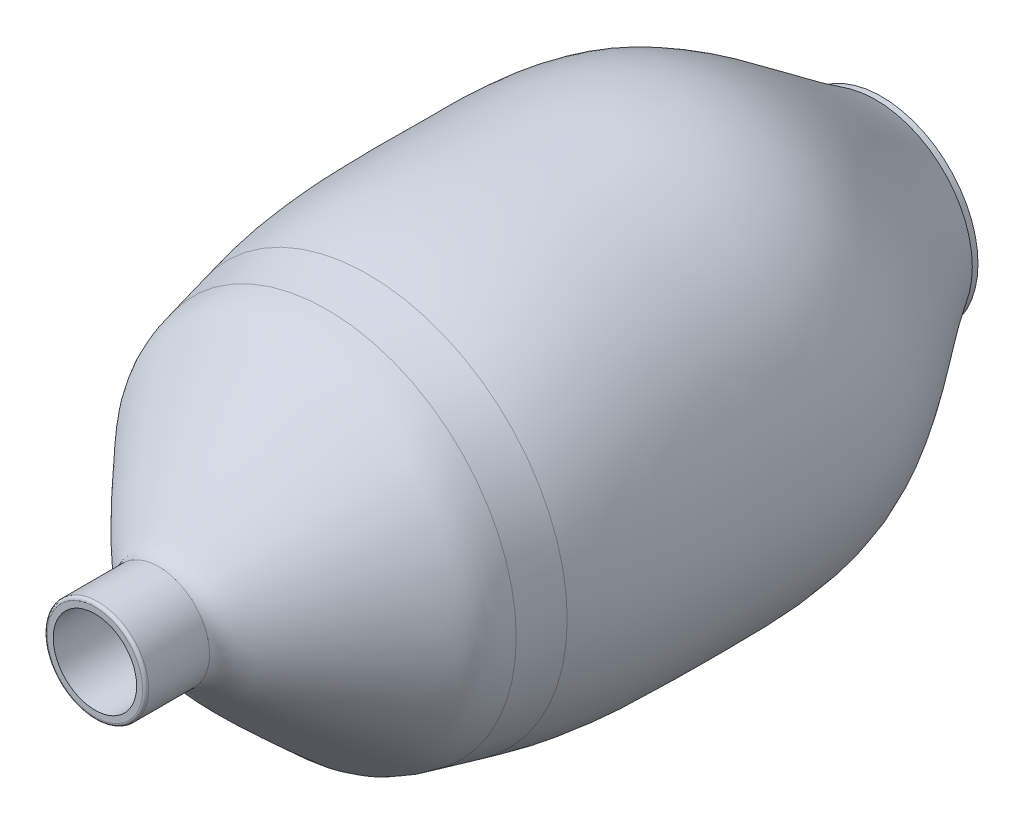
ISO-10303-21;
HEADER;
FILE_DESCRIPTION(('STEP AP214'),'2;1');
FILE_NAME('part.step','',(''),(''),'','','');
FILE_SCHEMA(('AUTOMOTIVE_DESIGN { 1 0 10303 214 1 1 1 1 }'));
ENDSEC;
DATA;
#1=APPLICATION_CONTEXT('core data for automotive mechanical design processes');
#2=APPLICATION_PROTOCOL_DEFINITION('international standard','automotive_design',2000,#1);
#3=PRODUCT_CONTEXT('',#1,'mechanical');
#4=PRODUCT('Part','Part','',(#3));
#5=PRODUCT_RELATED_PRODUCT_CATEGORY('part','',(#4));
#6=PRODUCT_DEFINITION_FORMATION('','',#4);
#7=PRODUCT_DEFINITION_CONTEXT('part definition',#1,'design');
#8=PRODUCT_DEFINITION('design','',#6,#7);
#9=PRODUCT_DEFINITION_SHAPE('','',#8);
#10=(LENGTH_UNIT() NAMED_UNIT(*) SI_UNIT(.MILLI.,.METRE.));
#11=(NAMED_UNIT(*) PLANE_ANGLE_UNIT() SI_UNIT($,.RADIAN.));
#12=(NAMED_UNIT(*) SI_UNIT($,.STERADIAN.) SOLID_ANGLE_UNIT());
#13=UNCERTAINTY_MEASURE_WITH_UNIT(LENGTH_MEASURE(1.E-05),#10,'distance_accuracy_value','');
#14=(GEOMETRIC_REPRESENTATION_CONTEXT(3) GLOBAL_UNCERTAINTY_ASSIGNED_CONTEXT((#13)) GLOBAL_UNIT_ASSIGNED_CONTEXT((#10,
#11,#12)) REPRESENTATION_CONTEXT('',''));
#15=CARTESIAN_POINT('',(0.,0.,0.));
#16=DIRECTION('',(0.,0.,1.));
#17=DIRECTION('',(1.,0.,0.));
#18=AXIS2_PLACEMENT_3D('',#15,#16,#17);
#19=CARTESIAN_POINT('',(0.,425.417840367619,-161.758556822154));
#20=CARTESIAN_POINT('',(0.,425.425512714381,-161.819419658135));
#21=CARTESIAN_POINT('',(0.,425.438145406539,-161.923120578848));
#22=CARTESIAN_POINT('',(0.,425.485106801781,-162.274720430272));
#23=CARTESIAN_POINT('',(0.,425.57793153603,-162.818178628396));
#24=CARTESIAN_POINT('',(0.,425.834440667119,-163.912921631338));
#25=CARTESIAN_POINT('',(0.,426.594243838935,-165.908538220751));
#26=CARTESIAN_POINT('',(0.,428.219309129448,-168.218246536566));
#27=CARTESIAN_POINT('',(0.,430.440677457558,-170.253422655751));
#28=CARTESIAN_POINT('',(0.,432.530119229495,-171.873383547063));
#29=CARTESIAN_POINT('',(0.,434.434741866312,-173.443350782065));
#30=CARTESIAN_POINT('',(0.,436.971222573604,-175.634399052684));
#31=CARTESIAN_POINT('',(0.,440.064030862751,-178.464087020507));
#32=CARTESIAN_POINT('',(0.,443.697716994735,-181.967987343029));
#33=CARTESIAN_POINT('',(0.,447.264008098938,-185.564282324131));
#34=CARTESIAN_POINT('',(0.,450.786660258123,-189.237236911521));
#35=CARTESIAN_POINT('',(0.,454.286260441308,-192.97079451453));
#36=CARTESIAN_POINT('',(0.,457.78307286654,-196.748383607076));
#37=CARTESIAN_POINT('',(0.,460.715970121881,-199.920029625462));
#38=CARTESIAN_POINT('',(0.,463.076565309463,-202.461471470719));
#39=CARTESIAN_POINT('',(0.,464.87674219713,-204.371809299966));
#40=CARTESIAN_POINT('',(0.,466.537080563887,-206.193375260955));
#41=CARTESIAN_POINT('',(0.,467.961738554563,-207.988492092352));
#42=CARTESIAN_POINT('',(0.,469.061554178301,-209.784645286835));
#43=CARTESIAN_POINT('',(0.,469.978689704152,-211.812427442754));
#44=CARTESIAN_POINT('',(0.,470.7294330568,-214.014031173279));
#45=CARTESIAN_POINT('',(0.,471.559261311098,-217.15353799278));
#46=CARTESIAN_POINT('',(0.,472.364854146844,-221.356158221017));
#47=CARTESIAN_POINT('',(0.,473.02842492808,-224.841883019088));
#48=CARTESIAN_POINT('',(0.,473.430003641095,-226.553419869668));
#49=B_SPLINE_CURVE_WITH_KNOTS('',3,(#19,#20,#21,#22,#23,#24,#25,#26,#27,#28,#29,#30,#31,#32,#33,
#34,#35,#36,#37,#38,#39,#40,#41,#42,#43,#44,#45,#46,#47,#48),.UNSPECIFIED.,.F.,.F.,(4,1,1,1,1,1,
1,1,1,1,1,1,1,1,1,1,1,1,1,1,1,1,1,1,1,1,1,4),(-0.00200560718281765,-4.59020192296008E-05,
0.00191380314435844,0.00583321347153453,0.0136720341258867,0.0293496754345911,
0.0607049580519998,0.0920602406694085,0.123415523286817,0.154770805904226,0.186126088521635,
0.248836653756452,0.311547218991269,0.374257784226087,0.436968349460904,0.499678914695722,
0.562389479930539,0.625100045165357,0.656455327782765,0.687810610400174,0.719165893017583,
0.750521175634991,0.7818764582524,0.813231740869809,0.844587023487217,0.875942306104626,
0.938652871339444,1.00136343657426),.UNSPECIFIED.);
#50=CARTESIAN_POINT('',(0.,411.49576309933,-150.958062517965));
#51=DIRECTION('',(0.,0.,1.));
#52=AXIS1_PLACEMENT('',#50,#51);
#53=SURFACE_OF_REVOLUTION('',#49,#52);
#54=CARTESIAN_POINT('',(0.,411.49576309933,-226.553419869668));
#55=DIRECTION('',(0.,0.,1.));
#56=DIRECTION('',(1.,0.,0.));
#57=AXIS2_PLACEMENT_3D('',#54,#55,#56);
#58=CIRCLE('',#57,61.9342405417654);
#59=CARTESIAN_POINT('',(61.9342405417654,411.49576309933,-226.553419869668));
#60=VERTEX_POINT('',#59);
#61=EDGE_CURVE('E57',#60,#60,#58,.T.);
#62=ORIENTED_EDGE('',*,*,#61,.F.);
#63=EDGE_LOOP('',(#62));
#64=FACE_BOUND('',#63,.T.);
#65=CARTESIAN_POINT('',(0.,411.49576309933,-161.758556822154));
#66=DIRECTION('',(0.,0.,1.));
#67=DIRECTION('',(1.,0.,0.));
#68=AXIS2_PLACEMENT_3D('',#65,#66,#67);
#69=CIRCLE('',#68,13.9220772682896);
#70=CARTESIAN_POINT('',(13.9220772682896,411.49576309933,-161.758556822154));
#71=VERTEX_POINT('',#70);
#72=EDGE_CURVE('E81',#71,#71,#69,.T.);
#73=ORIENTED_EDGE('',*,*,#72,.T.);
#74=EDGE_LOOP('',(#73));
#75=FACE_BOUND('',#74,.T.);
#76=ADVANCED_FACE('F37',(#64,#75),#53,.T.);
#77=CARTESIAN_POINT('',(0.,473.430003641095,-226.553419869668));
#78=CARTESIAN_POINT('',(0.,473.730017583264,-227.511334155473));
#79=CARTESIAN_POINT('',(0.,474.313596578574,-229.44239532702));
#80=CARTESIAN_POINT('',(0.,475.370464774843,-233.257020053952));
#81=CARTESIAN_POINT('',(0.,476.518287603895,-237.999385716587));
#82=CARTESIAN_POINT('',(0.,477.637412490232,-243.642274171863));
#83=CARTESIAN_POINT('',(0.,478.823310695443,-251.124673242805));
#84=CARTESIAN_POINT('',(0.,479.796111148413,-260.426034200905));
#85=CARTESIAN_POINT('',(0.,480.356515998269,-271.595398427168));
#86=CARTESIAN_POINT('',(0.,480.523776332559,-282.853796923385));
#87=CARTESIAN_POINT('',(0.,480.496092928094,-294.287321450316));
#88=CARTESIAN_POINT('',(0.,480.54426970025,-305.947870925968));
#89=CARTESIAN_POINT('',(0.,480.3296923214,-317.527507840143));
#90=CARTESIAN_POINT('',(0.,479.392260986087,-328.860803115387));
#91=CARTESIAN_POINT('',(0.,477.348556137937,-339.759791401836));
#92=CARTESIAN_POINT('',(0.,473.722918078161,-350.006050711749));
#93=CARTESIAN_POINT('',(0.,468.470424151346,-359.897969321294));
#94=CARTESIAN_POINT('',(0.,462.162246784627,-369.516520294424));
#95=CARTESIAN_POINT('',(0.,455.277164683212,-378.961959726458));
#96=CARTESIAN_POINT('',(0.,449.497652391404,-386.775311569873));
#97=CARTESIAN_POINT('',(0.,445.099132848732,-393.072202451468));
#98=CARTESIAN_POINT('',(0.,443.034000767627,-396.224580081428));
#99=CARTESIAN_POINT('',(0.,442.030732015512,-397.82968935676));
#100=B_SPLINE_CURVE_WITH_KNOTS('',3,(#77,#78,#79,#80,#81,#82,#83,#84,#85,#86,#87,#88,#89,#90,
#91,#92,#93,#94,#95,#96,#97,#98,#99),.UNSPECIFIED.,.F.,.F.,(4,1,1,1,1,1,1,1,1,1,1,1,1,1,1,1,1,1,
1,1,4),(-0.000548601344724432,0.014939031849553,0.0304266650438305,0.0614019314323854,
0.0923771978209403,0.123352464209495,0.185302996986605,0.247253529763715,0.309204062540825,
0.371154595317934,0.433105128095044,0.495055660872154,0.557006193649264,0.618956726426374,
0.680907259203484,0.742857791980593,0.804808324757703,0.866758857534813,0.928709390311923,
0.959684656700478,0.990659923089033),.UNSPECIFIED.);
#101=CARTESIAN_POINT('',(0.,411.49576309933,-150.958062517965));
#102=DIRECTION('',(0.,0.,1.));
#103=AXIS1_PLACEMENT('',#101,#102);
#104=SURFACE_OF_REVOLUTION('',#100,#103);
#105=CARTESIAN_POINT('',(0.,411.49576309933,-397.82968935676));
#106=DIRECTION('',(0.,0.,1.));
#107=DIRECTION('',(1.,0.,0.));
#108=AXIS2_PLACEMENT_3D('',#105,#106,#107);
#109=CIRCLE('',#108,30.5349689161824);
#110=CARTESIAN_POINT('',(30.5349689161824,411.49576309933,-397.82968935676));
#111=VERTEX_POINT('',#110);
#112=EDGE_CURVE('E60',#111,#111,#109,.T.);
#113=ORIENTED_EDGE('',*,*,#112,.F.);
#114=EDGE_LOOP('',(#113));
#115=FACE_BOUND('',#114,.T.);
#116=ORIENTED_EDGE('',*,*,#61,.T.);
#117=EDGE_LOOP('',(#116));
#118=FACE_BOUND('',#117,.T.);
#119=ADVANCED_FACE('F120',(#115,#118),#104,.T.);
#120=CARTESIAN_POINT('',(0.,442.030732015512,-397.82968935676));
#121=DIRECTION('',(0.,0.,-1.));
#122=DIRECTION('',(-1.,0.,0.));
#123=AXIS2_PLACEMENT_3D('',#120,#121,#122);
#124=PLANE('',#123);
#125=CARTESIAN_POINT('',(0.,411.49576309933,-397.82968935676));
#126=DIRECTION('',(0.,0.,1.));
#127=DIRECTION('',(1.,0.,0.));
#128=AXIS2_PLACEMENT_3D('',#125,#126,#127);
#129=CIRCLE('',#128,25.9694899386658);
#130=CARTESIAN_POINT('',(25.9694899386658,411.49576309933,-397.82968935676));
#131=VERTEX_POINT('',#130);
#132=EDGE_CURVE('E63',#131,#131,#129,.T.);
#133=ORIENTED_EDGE('',*,*,#132,.F.);
#134=EDGE_LOOP('',(#133));
#135=FACE_BOUND('',#134,.T.);
#136=ORIENTED_EDGE('',*,*,#112,.T.);
#137=EDGE_LOOP('',(#136));
#138=FACE_BOUND('',#137,.T.);
#139=ADVANCED_FACE('F116',(#135,#138),#124,.F.);
#140=CARTESIAN_POINT('',(0.,411.49576309933,-150.958062517965));
#141=DIRECTION('',(0.,0.,1.));
#142=DIRECTION('',(1.,0.,0.));
#143=AXIS2_PLACEMENT_3D('',#140,#141,#142);
#144=CYLINDRICAL_SURFACE('',#143,25.9694899386658);
#145=CARTESIAN_POINT('',(0.,411.49576309933,-402.727304025255));
#146=DIRECTION('',(0.,0.,1.));
#147=DIRECTION('',(1.,0.,0.));
#148=AXIS2_PLACEMENT_3D('',#145,#146,#147);
#149=CIRCLE('',#148,25.9694899386658);
#150=CARTESIAN_POINT('',(25.9694899386658,411.49576309933,-402.727304025255));
#151=VERTEX_POINT('',#150);
#152=EDGE_CURVE('E66',#151,#151,#149,.T.);
#153=ORIENTED_EDGE('',*,*,#152,.F.);
#154=EDGE_LOOP('',(#153));
#155=FACE_BOUND('',#154,.T.);
#156=ORIENTED_EDGE('',*,*,#132,.T.);
#157=EDGE_LOOP('',(#156));
#158=FACE_BOUND('',#157,.T.);
#159=ADVANCED_FACE('F112',(#155,#158),#144,.F.);
#160=CARTESIAN_POINT('',(0.,443.706389043571,-402.727304025255));
#161=DIRECTION('',(0.,0.,1.));
#162=DIRECTION('',(1.,0.,0.));
#163=AXIS2_PLACEMENT_3D('',#160,#161,#162);
#164=PLANE('',#163);
#165=CARTESIAN_POINT('',(0.,411.49576309933,-402.727304025255));
#166=DIRECTION('',(0.,0.,1.));
#167=DIRECTION('',(1.,0.,0.));
#168=AXIS2_PLACEMENT_3D('',#165,#166,#167);
#169=CIRCLE('',#168,32.2106259442411);
#170=CARTESIAN_POINT('',(32.2106259442411,411.49576309933,-402.727304025255));
#171=VERTEX_POINT('',#170);
#172=EDGE_CURVE('E69',#171,#171,#169,.T.);
#173=ORIENTED_EDGE('',*,*,#172,.F.);
#174=EDGE_LOOP('',(#173));
#175=FACE_BOUND('',#174,.T.);
#176=ORIENTED_EDGE('',*,*,#152,.T.);
#177=EDGE_LOOP('',(#176));
#178=FACE_BOUND('',#177,.T.);
#179=ADVANCED_FACE('F108',(#175,#178),#164,.F.);
#180=CARTESIAN_POINT('',(0.,411.49576309933,-150.958062517965));
#181=DIRECTION('',(0.,0.,1.));
#182=DIRECTION('',(1.,0.,0.));
#183=AXIS2_PLACEMENT_3D('',#180,#181,#182);
#184=CYLINDRICAL_SURFACE('',#183,32.2106259442411);
#185=CARTESIAN_POINT('',(0.,411.49576309933,-400.82968935676));
#186=DIRECTION('',(0.,0.,1.));
#187=DIRECTION('',(1.,0.,0.));
#188=AXIS2_PLACEMENT_3D('',#185,#186,#187);
#189=CIRCLE('',#188,32.2106259442411);
#190=CARTESIAN_POINT('',(32.2106259442411,411.49576309933,-400.82968935676));
#191=VERTEX_POINT('',#190);
#192=EDGE_CURVE('E72',#191,#191,#189,.T.);
#193=ORIENTED_EDGE('',*,*,#192,.F.);
#194=EDGE_LOOP('',(#193));
#195=FACE_BOUND('',#194,.T.);
#196=ORIENTED_EDGE('',*,*,#172,.T.);
#197=EDGE_LOOP('',(#196));
#198=FACE_BOUND('',#197,.T.);
#199=ADVANCED_FACE('F105',(#195,#198),#184,.T.);
#200=CARTESIAN_POINT('',(0.,443.706389043571,-400.82968935676));
#201=CARTESIAN_POINT('',(0.,454.456310689748,-383.102413409264));
#202=CARTESIAN_POINT('',(0.,484.072298296008,-352.940868229378));
#203=CARTESIAN_POINT('',(0.,483.178078387969,-288.266169538825));
#204=CARTESIAN_POINT('',(0.,483.947478248421,-250.097154315785));
#205=CARTESIAN_POINT('',(0.,476.325643567536,-225.761404209999));
#206=B_SPLINE_CURVE_WITH_KNOTS('',3,(#200,#201,#202,#203,#204,#205),.UNSPECIFIED.,.F.,.F.,(4,1,
1,4),(0.,0.352047758415312,0.617174504800199,1.),.UNSPECIFIED.);
#207=CARTESIAN_POINT('',(0.,411.49576309933,-150.958062517965));
#208=DIRECTION('',(0.,0.,1.));
#209=AXIS1_PLACEMENT('',#207,#208);
#210=SURFACE_OF_REVOLUTION('',#206,#209);
#211=CARTESIAN_POINT('',(0.,411.49576309933,-231.411066437942));
#212=DIRECTION('',(0.,0.,1.));
#213=DIRECTION('',(1.,0.,0.));
#214=AXIS2_PLACEMENT_3D('',#211,#212,#213);
#215=CIRCLE('',#214,66.4663589238512);
#216=CARTESIAN_POINT('',(66.4663589238512,411.49576309933,-231.411066437942));
#217=VERTEX_POINT('',#216);
#218=EDGE_CURVE('E10',#217,#217,#215,.F.);
#219=ORIENTED_EDGE('',*,*,#218,.T.);
#220=EDGE_LOOP('',(#219));
#221=FACE_BOUND('',#220,.T.);
#222=ORIENTED_EDGE('',*,*,#192,.T.);
#223=EDGE_LOOP('',(#222));
#224=FACE_BOUND('',#223,.T.);
#225=ADVANCED_FACE('F101',(#221,#224),#210,.T.);
#226=CARTESIAN_POINT('',(0.,476.325643567536,-225.761404209999));
#227=CARTESIAN_POINT('',(0.,474.874030185985,-219.574597701588));
#228=CARTESIAN_POINT('',(0.,474.129612163033,-209.789233312228));
#229=CARTESIAN_POINT('',(0.,459.187808019763,-194.029510768355));
#230=CARTESIAN_POINT('',(0.,447.658310633034,-180.956918186172));
#231=CARTESIAN_POINT('',(0.,433.839023317356,-168.912039636391));
#232=CARTESIAN_POINT('',(0.,428.899023226921,-165.387317702616));
#233=CARTESIAN_POINT('',(0.,428.417840367619,-161.570212669265));
#234=B_SPLINE_CURVE_WITH_KNOTS('',3,(#226,#227,#228,#229,#230,#231,#232,#233),.UNSPECIFIED.,.F.,
.F.,(4,1,1,1,1,4),(0.,0.237092796366132,0.328217588560988,0.782889938869158,0.87709411953602,
1.),.UNSPECIFIED.);
#235=CARTESIAN_POINT('',(0.,411.49576309933,-150.958062517965));
#236=DIRECTION('',(0.,0.,1.));
#237=AXIS1_PLACEMENT('',#235,#236);
#238=SURFACE_OF_REVOLUTION('',#234,#237);
#239=CARTESIAN_POINT('',(0.,411.49576309933,-217.653251850094));
#240=DIRECTION('',(0.,0.,1.));
#241=DIRECTION('',(1.,0.,0.));
#242=AXIS2_PLACEMENT_3D('',#239,#240,#241);
#243=CIRCLE('',#242,63.1961910137844);
#244=CARTESIAN_POINT('',(63.1961910137844,411.49576309933,-217.653251850094));
#245=VERTEX_POINT('',#244);
#246=EDGE_CURVE('E44',#245,#245,#243,.T.);
#247=ORIENTED_EDGE('',*,*,#246,.T.);
#248=EDGE_LOOP('',(#247));
#249=FACE_BOUND('',#248,.T.);
#250=CARTESIAN_POINT('',(0.,411.49576309933,-161.570212669265));
#251=DIRECTION('',(0.,0.,1.));
#252=DIRECTION('',(1.,0.,0.));
#253=AXIS2_PLACEMENT_3D('',#250,#251,#252);
#254=CIRCLE('',#253,16.9220772682896);
#255=CARTESIAN_POINT('',(16.9220772682896,411.49576309933,-161.570212669265));
#256=VERTEX_POINT('',#255);
#257=EDGE_CURVE('E75',#256,#256,#254,.T.);
#258=ORIENTED_EDGE('',*,*,#257,.F.);
#259=EDGE_LOOP('',(#258));
#260=FACE_BOUND('',#259,.T.);
#261=ADVANCED_FACE('F96',(#249,#260),#238,.T.);
#262=CARTESIAN_POINT('',(0.,411.49576309933,-150.958062517965));
#263=DIRECTION('',(0.,0.,1.));
#264=DIRECTION('',(1.,0.,0.));
#265=AXIS2_PLACEMENT_3D('',#262,#263,#264);
#266=CYLINDRICAL_SURFACE('',#265,16.9220772682896);
#267=CARTESIAN_POINT('',(0.,411.49576309933,-141.267729397868));
#268=DIRECTION('',(0.,0.,-1.));
#269=DIRECTION('',(-1.,0.,0.));
#270=AXIS2_PLACEMENT_3D('',#267,#268,#269);
#271=CIRCLE('',#270,16.9220772682896);
#272=CARTESIAN_POINT('',(-16.9220772682896,411.49576309933,-141.267729397868));
#273=VERTEX_POINT('',#272);
#274=EDGE_CURVE('E48',#273,#273,#271,.T.);
#275=ORIENTED_EDGE('',*,*,#274,.T.);
#276=EDGE_LOOP('',(#275));
#277=FACE_BOUND('',#276,.T.);
#278=ORIENTED_EDGE('',*,*,#257,.T.);
#279=EDGE_LOOP('',(#278));
#280=FACE_BOUND('',#279,.T.);
#281=ADVANCED_FACE('F100',(#277,#280),#266,.T.);
#282=CARTESIAN_POINT('',(0.,425.417840367619,-140.267729397868));
#283=DIRECTION('',(0.,0.,-1.));
#284=DIRECTION('',(-1.,0.,0.));
#285=AXIS2_PLACEMENT_3D('',#282,#283,#284);
#286=PLANE('',#285);
#287=CARTESIAN_POINT('',(0.,411.49576309933,-140.267729397868));
#288=DIRECTION('',(0.,0.,-1.));
#289=DIRECTION('',(-1.,0.,0.));
#290=AXIS2_PLACEMENT_3D('',#287,#288,#289);
#291=CIRCLE('',#290,15.9220772682896);
#292=CARTESIAN_POINT('',(-15.9220772682896,411.49576309933,-140.267729397868));
#293=VERTEX_POINT('',#292);
#294=EDGE_CURVE('E52',#293,#293,#291,.F.);
#295=ORIENTED_EDGE('',*,*,#294,.T.);
#296=EDGE_LOOP('',(#295));
#297=FACE_BOUND('',#296,.T.);
#298=CARTESIAN_POINT('',(0.,411.49576309933,-140.267729397868));
#299=DIRECTION('',(0.,0.,1.));
#300=DIRECTION('',(1.,0.,0.));
#301=AXIS2_PLACEMENT_3D('',#298,#299,#300);
#302=CIRCLE('',#301,13.9220772682896);
#303=CARTESIAN_POINT('',(13.9220772682896,411.49576309933,-140.267729397868));
#304=VERTEX_POINT('',#303);
#305=EDGE_CURVE('E78',#304,#304,#302,.T.);
#306=ORIENTED_EDGE('',*,*,#305,.F.);
#307=EDGE_LOOP('',(#306));
#308=FACE_BOUND('',#307,.T.);
#309=ADVANCED_FACE('F149',(#297,#308),#286,.F.);
#310=CARTESIAN_POINT('',(0.,411.49576309933,-150.958062517965));
#311=DIRECTION('',(0.,0.,1.));
#312=DIRECTION('',(1.,0.,0.));
#313=AXIS2_PLACEMENT_3D('',#310,#311,#312);
#314=CYLINDRICAL_SURFACE('',#313,13.9220772682896);
#315=ORIENTED_EDGE('',*,*,#72,.F.);
#316=EDGE_LOOP('',(#315));
#317=FACE_BOUND('',#316,.T.);
#318=ORIENTED_EDGE('',*,*,#305,.T.);
#319=EDGE_LOOP('',(#318));
#320=FACE_BOUND('',#319,.T.);
#321=ADVANCED_FACE('F142',(#317,#320),#314,.F.);
#322=CARTESIAN_POINT('',(0.,411.49576309933,-141.267729397868));
#323=DIRECTION('',(0.,0.,-1.));
#324=DIRECTION('',(-1.,0.,0.));
#325=AXIS2_PLACEMENT_3D('',#322,#323,#324);
#326=TOROIDAL_SURFACE('',#325,15.9220772682896,1.);
#327=ORIENTED_EDGE('',*,*,#274,.F.);
#328=EDGE_LOOP('',(#327));
#329=FACE_BOUND('',#328,.T.);
#330=ORIENTED_EDGE('',*,*,#294,.F.);
#331=EDGE_LOOP('',(#330));
#332=FACE_BOUND('',#331,.T.);
#333=ADVANCED_FACE('F140',(#329,#332),#326,.T.);
#334=CARTESIAN_POINT('',(0.,411.49576309933,-164.197462779308));
#335=DIRECTION('',(0.,0.,1.));
#336=DIRECTION('',(1.,0.,0.));
#337=AXIS2_PLACEMENT_3D('',#334,#335,#336);
#338=TOROIDAL_SURFACE('',#337,318.663368190853,261.);
#339=ORIENTED_EDGE('',*,*,#218,.F.);
#340=EDGE_LOOP('',(#339));
#341=FACE_BOUND('',#340,.T.);
#342=ORIENTED_EDGE('',*,*,#246,.F.);
#343=EDGE_LOOP('',(#342));
#344=FACE_BOUND('',#343,.T.);
#345=ADVANCED_FACE('F39',(#341,#344),#338,.F.);
#346=CLOSED_SHELL('',(#76,#119,#139,#159,#179,#199,#225,#261,#281,#309,#321,#333,#345));
#347=MANIFOLD_SOLID_BREP('B2',#346);
#348=ADVANCED_BREP_SHAPE_REPRESENTATION('',(#18,#347),#14);
#349=SHAPE_DEFINITION_REPRESENTATION(#9,#348);
ENDSEC;
END-ISO-10303-21;
